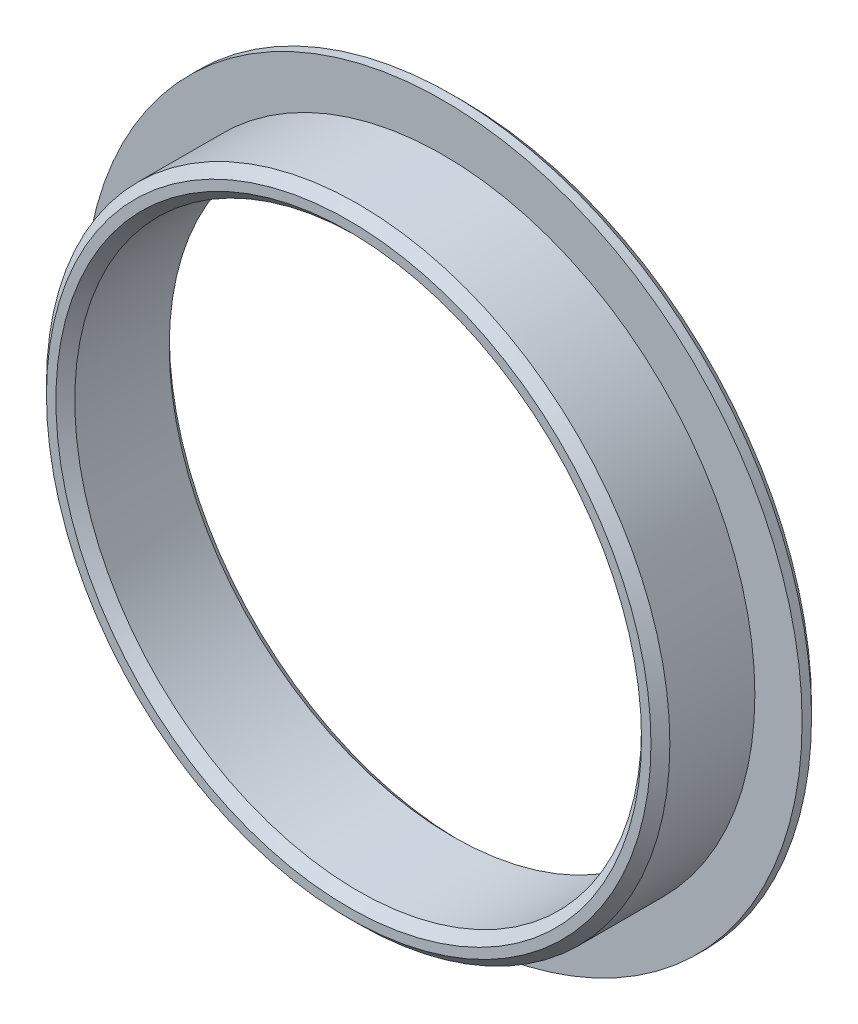
ISO-10303-21;
HEADER;
FILE_DESCRIPTION(('STEP AP214'),'2;1');
FILE_NAME('part.step','',(''),(''),'','','');
FILE_SCHEMA(('AUTOMOTIVE_DESIGN { 1 0 10303 214 1 1 1 1 }'));
ENDSEC;
DATA;
#1=APPLICATION_CONTEXT('core data for automotive mechanical design processes');
#2=APPLICATION_PROTOCOL_DEFINITION('international standard','automotive_design',2000,#1);
#3=PRODUCT_CONTEXT('',#1,'mechanical');
#4=PRODUCT('Part','Part','',(#3));
#5=PRODUCT_RELATED_PRODUCT_CATEGORY('part','',(#4));
#6=PRODUCT_DEFINITION_FORMATION('','',#4);
#7=PRODUCT_DEFINITION_CONTEXT('part definition',#1,'design');
#8=PRODUCT_DEFINITION('design','',#6,#7);
#9=PRODUCT_DEFINITION_SHAPE('','',#8);
#10=(LENGTH_UNIT() NAMED_UNIT(*) SI_UNIT(.MILLI.,.METRE.));
#11=(NAMED_UNIT(*) PLANE_ANGLE_UNIT() SI_UNIT($,.RADIAN.));
#12=(NAMED_UNIT(*) SI_UNIT($,.STERADIAN.) SOLID_ANGLE_UNIT());
#13=UNCERTAINTY_MEASURE_WITH_UNIT(LENGTH_MEASURE(1.E-05),#10,'distance_accuracy_value','');
#14=(GEOMETRIC_REPRESENTATION_CONTEXT(3) GLOBAL_UNCERTAINTY_ASSIGNED_CONTEXT((#13)) GLOBAL_UNIT_ASSIGNED_CONTEXT((#10,
#11,#12)) REPRESENTATION_CONTEXT('',''));
#15=CARTESIAN_POINT('',(0.,0.,0.));
#16=DIRECTION('',(0.,0.,1.));
#17=DIRECTION('',(1.,0.,0.));
#18=AXIS2_PLACEMENT_3D('',#15,#16,#17);
#19=CARTESIAN_POINT('',(0.,0.,2.));
#20=DIRECTION('',(0.,0.,1.));
#21=DIRECTION('',(1.,0.,0.));
#22=AXIS2_PLACEMENT_3D('',#19,#20,#21);
#23=PLANE('',#22);
#24=CARTESIAN_POINT('',(0.,0.,2.));
#25=DIRECTION('',(0.,0.,1.));
#26=DIRECTION('',(1.,0.,0.));
#27=AXIS2_PLACEMENT_3D('',#24,#25,#26);
#28=CIRCLE('',#27,33.);
#29=CARTESIAN_POINT('',(33.,0.,2.));
#30=VERTEX_POINT('',#29);
#31=EDGE_CURVE('E36',#30,#30,#28,.T.);
#32=ORIENTED_EDGE('',*,*,#31,.F.);
#33=EDGE_LOOP('',(#32));
#34=FACE_BOUND('',#33,.T.);
#35=CARTESIAN_POINT('',(0.,0.,2.));
#36=DIRECTION('',(0.,0.,1.));
#37=DIRECTION('',(1.,0.,0.));
#38=AXIS2_PLACEMENT_3D('',#35,#36,#37);
#39=CIRCLE('',#38,38.);
#40=CARTESIAN_POINT('',(38.,0.,2.));
#41=VERTEX_POINT('',#40);
#42=EDGE_CURVE('E17',#41,#41,#39,.F.);
#43=ORIENTED_EDGE('',*,*,#42,.F.);
#44=EDGE_LOOP('',(#43));
#45=FACE_BOUND('',#44,.T.);
#46=ADVANCED_FACE('F14',(#34,#45),#23,.T.);
#47=CARTESIAN_POINT('',(0.,0.,0.));
#48=DIRECTION('',(0.,0.,1.));
#49=DIRECTION('',(1.,0.,0.));
#50=AXIS2_PLACEMENT_3D('',#47,#48,#49);
#51=CYLINDRICAL_SURFACE('',#50,38.);
#52=CARTESIAN_POINT('',(0.,0.,1.));
#53=DIRECTION('',(0.,0.,1.));
#54=DIRECTION('',(1.,0.,0.));
#55=AXIS2_PLACEMENT_3D('',#52,#53,#54);
#56=CIRCLE('',#55,38.);
#57=CARTESIAN_POINT('',(38.,0.,0.999999999999998));
#58=VERTEX_POINT('',#57);
#59=EDGE_CURVE('E33',#58,#58,#56,.F.);
#60=ORIENTED_EDGE('',*,*,#59,.F.);
#61=EDGE_LOOP('',(#60));
#62=FACE_BOUND('',#61,.T.);
#63=ORIENTED_EDGE('',*,*,#42,.T.);
#64=EDGE_LOOP('',(#63));
#65=FACE_BOUND('',#64,.T.);
#66=ADVANCED_FACE('F52',(#62,#65),#51,.T.);
#67=CARTESIAN_POINT('',(0.,0.,0.));
#68=DIRECTION('',(0.,0.,1.));
#69=DIRECTION('',(1.,0.,0.));
#70=AXIS2_PLACEMENT_3D('',#67,#68,#69);
#71=CYLINDRICAL_SURFACE('',#70,33.);
#72=ORIENTED_EDGE('',*,*,#31,.T.);
#73=EDGE_LOOP('',(#72));
#74=FACE_BOUND('',#73,.T.);
#75=CARTESIAN_POINT('',(0.,0.,11.));
#76=DIRECTION('',(0.,0.,-1.));
#77=DIRECTION('',(1.,0.,0.));
#78=AXIS2_PLACEMENT_3D('',#75,#76,#77);
#79=CIRCLE('',#78,33.);
#80=CARTESIAN_POINT('',(33.,0.,11.));
#81=VERTEX_POINT('',#80);
#82=EDGE_CURVE('E29',#81,#81,#79,.F.);
#83=ORIENTED_EDGE('',*,*,#82,.F.);
#84=EDGE_LOOP('',(#83));
#85=FACE_BOUND('',#84,.T.);
#86=ADVANCED_FACE('F60',(#74,#85),#71,.T.);
#87=CARTESIAN_POINT('',(0.,0.,0.999999999999999));
#88=DIRECTION('',(0.,0.,1.));
#89=DIRECTION('',(0.,-1.,0.));
#90=AXIS2_PLACEMENT_3D('',#87,#88,#89);
#91=CONICAL_SURFACE('',#90,38.,0.78539816339745);
#92=CARTESIAN_POINT('',(0.,0.,0.));
#93=DIRECTION('',(0.,0.,1.));
#94=DIRECTION('',(0.,-1.,0.));
#95=AXIS2_PLACEMENT_3D('',#92,#93,#94);
#96=CIRCLE('',#95,37.);
#97=CARTESIAN_POINT('',(0.,-37.,0.));
#98=VERTEX_POINT('',#97);
#99=EDGE_CURVE('E32',#98,#98,#96,.T.);
#100=ORIENTED_EDGE('',*,*,#99,.T.);
#101=EDGE_LOOP('',(#100));
#102=FACE_BOUND('',#101,.T.);
#103=ORIENTED_EDGE('',*,*,#59,.T.);
#104=EDGE_LOOP('',(#103));
#105=FACE_BOUND('',#104,.T.);
#106=ADVANCED_FACE('F89',(#102,#105),#91,.T.);
#107=CARTESIAN_POINT('',(0.,0.,11.));
#108=DIRECTION('',(0.,0.,-1.));
#109=DIRECTION('',(-1.,0.,0.));
#110=AXIS2_PLACEMENT_3D('',#107,#108,#109);
#111=CONICAL_SURFACE('',#110,33.,0.785398163397447);
#112=ORIENTED_EDGE('',*,*,#82,.T.);
#113=EDGE_LOOP('',(#112));
#114=FACE_BOUND('',#113,.T.);
#115=CARTESIAN_POINT('',(0.,0.,12.));
#116=DIRECTION('',(0.,0.,-1.));
#117=DIRECTION('',(-1.,0.,0.));
#118=AXIS2_PLACEMENT_3D('',#115,#116,#117);
#119=CIRCLE('',#118,32.);
#120=CARTESIAN_POINT('',(-32.,0.,12.));
#121=VERTEX_POINT('',#120);
#122=EDGE_CURVE('E42',#121,#121,#119,.F.);
#123=ORIENTED_EDGE('',*,*,#122,.F.);
#124=EDGE_LOOP('',(#123));
#125=FACE_BOUND('',#124,.T.);
#126=ADVANCED_FACE('F85',(#114,#125),#111,.T.);
#127=CARTESIAN_POINT('',(0.,0.,0.));
#128=DIRECTION('',(0.,0.,1.));
#129=DIRECTION('',(1.,0.,0.));
#130=AXIS2_PLACEMENT_3D('',#127,#128,#129);
#131=PLANE('',#130);
#132=CARTESIAN_POINT('',(0.,0.,0.));
#133=DIRECTION('',(0.,0.,-1.));
#134=DIRECTION('',(-1.,0.,0.));
#135=AXIS2_PLACEMENT_3D('',#132,#133,#134);
#136=CIRCLE('',#135,31.);
#137=CARTESIAN_POINT('',(-31.,0.,0.));
#138=VERTEX_POINT('',#137);
#139=EDGE_CURVE('E39',#138,#138,#136,.F.);
#140=ORIENTED_EDGE('',*,*,#139,.T.);
#141=EDGE_LOOP('',(#140));
#142=FACE_BOUND('',#141,.T.);
#143=ORIENTED_EDGE('',*,*,#99,.F.);
#144=EDGE_LOOP('',(#143));
#145=FACE_BOUND('',#144,.T.);
#146=ADVANCED_FACE('F81',(#142,#145),#131,.F.);
#147=CARTESIAN_POINT('',(0.,0.,12.));
#148=DIRECTION('',(0.,0.,1.));
#149=DIRECTION('',(1.,0.,0.));
#150=AXIS2_PLACEMENT_3D('',#147,#148,#149);
#151=PLANE('',#150);
#152=CARTESIAN_POINT('',(0.,0.,12.));
#153=DIRECTION('',(0.,0.,1.));
#154=DIRECTION('',(1.,0.,0.));
#155=AXIS2_PLACEMENT_3D('',#152,#153,#154);
#156=CIRCLE('',#155,31.);
#157=CARTESIAN_POINT('',(31.,0.,12.));
#158=VERTEX_POINT('',#157);
#159=EDGE_CURVE('E26',#158,#158,#156,.F.);
#160=ORIENTED_EDGE('',*,*,#159,.T.);
#161=EDGE_LOOP('',(#160));
#162=FACE_BOUND('',#161,.T.);
#163=ORIENTED_EDGE('',*,*,#122,.T.);
#164=EDGE_LOOP('',(#163));
#165=FACE_BOUND('',#164,.T.);
#166=ADVANCED_FACE('F77',(#162,#165),#151,.T.);
#167=CARTESIAN_POINT('',(0.,0.,0.));
#168=DIRECTION('',(0.,0.,-1.));
#169=DIRECTION('',(-1.,0.,0.));
#170=AXIS2_PLACEMENT_3D('',#167,#168,#169);
#171=CONICAL_SURFACE('',#170,31.,0.785398163397449);
#172=ORIENTED_EDGE('',*,*,#139,.F.);
#173=EDGE_LOOP('',(#172));
#174=FACE_BOUND('',#173,.T.);
#175=CARTESIAN_POINT('',(0.,0.,1.));
#176=DIRECTION('',(0.,0.,1.));
#177=DIRECTION('',(1.,0.,0.));
#178=AXIS2_PLACEMENT_3D('',#175,#176,#177);
#179=CIRCLE('',#178,30.);
#180=CARTESIAN_POINT('',(30.,0.,1.));
#181=VERTEX_POINT('',#180);
#182=EDGE_CURVE('E21',#181,#181,#179,.T.);
#183=ORIENTED_EDGE('',*,*,#182,.T.);
#184=EDGE_LOOP('',(#183));
#185=FACE_BOUND('',#184,.T.);
#186=ADVANCED_FACE('F70',(#174,#185),#171,.F.);
#187=CARTESIAN_POINT('',(0.,0.,12.));
#188=DIRECTION('',(0.,0.,1.));
#189=DIRECTION('',(1.,0.,0.));
#190=AXIS2_PLACEMENT_3D('',#187,#188,#189);
#191=CONICAL_SURFACE('',#190,31.,0.785398163397448);
#192=CARTESIAN_POINT('',(0.,0.,11.));
#193=DIRECTION('',(0.,0.,1.));
#194=DIRECTION('',(1.,0.,0.));
#195=AXIS2_PLACEMENT_3D('',#192,#193,#194);
#196=CIRCLE('',#195,30.);
#197=CARTESIAN_POINT('',(30.,0.,11.));
#198=VERTEX_POINT('',#197);
#199=EDGE_CURVE('E10',#198,#198,#196,.F.);
#200=ORIENTED_EDGE('',*,*,#199,.T.);
#201=EDGE_LOOP('',(#200));
#202=FACE_BOUND('',#201,.T.);
#203=ORIENTED_EDGE('',*,*,#159,.F.);
#204=EDGE_LOOP('',(#203));
#205=FACE_BOUND('',#204,.T.);
#206=ADVANCED_FACE('F64',(#202,#205),#191,.F.);
#207=CARTESIAN_POINT('',(0.,0.,0.));
#208=DIRECTION('',(0.,0.,1.));
#209=DIRECTION('',(1.,0.,0.));
#210=AXIS2_PLACEMENT_3D('',#207,#208,#209);
#211=CYLINDRICAL_SURFACE('',#210,30.);
#212=ORIENTED_EDGE('',*,*,#182,.F.);
#213=EDGE_LOOP('',(#212));
#214=FACE_BOUND('',#213,.T.);
#215=ORIENTED_EDGE('',*,*,#199,.F.);
#216=EDGE_LOOP('',(#215));
#217=FACE_BOUND('',#216,.T.);
#218=ADVANCED_FACE('F62',(#214,#217),#211,.F.);
#219=CLOSED_SHELL('',(#46,#66,#86,#106,#126,#146,#166,#186,#206,#218));
#220=MANIFOLD_SOLID_BREP('B1',#219);
#221=ADVANCED_BREP_SHAPE_REPRESENTATION('',(#18,#220),#14);
#222=SHAPE_DEFINITION_REPRESENTATION(#9,#221);
ENDSEC;
END-ISO-10303-21;
